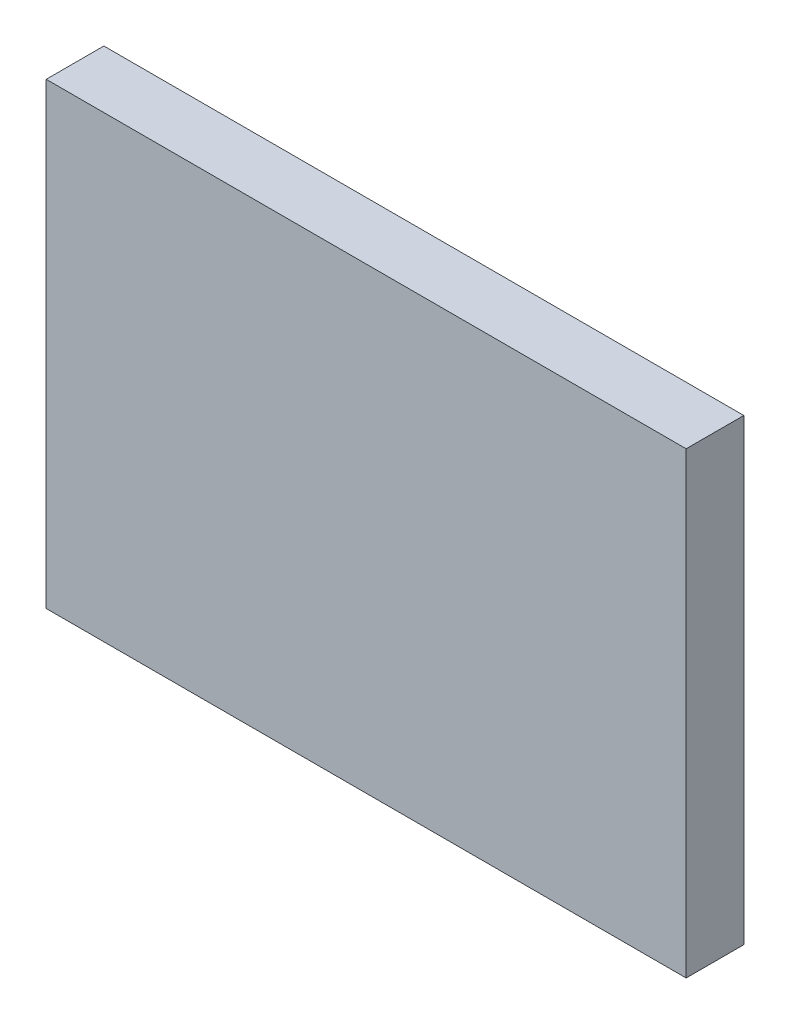
ISO-10303-21;
HEADER;
FILE_DESCRIPTION(('STEP AP214'),'2;1');
FILE_NAME('part.step','',(''),(''),'','','');
FILE_SCHEMA(('AUTOMOTIVE_DESIGN { 1 0 10303 214 1 1 1 1 }'));
ENDSEC;
DATA;
#1=APPLICATION_CONTEXT('core data for automotive mechanical design processes');
#2=APPLICATION_PROTOCOL_DEFINITION('international standard','automotive_design',2000,#1);
#3=PRODUCT_CONTEXT('',#1,'mechanical');
#4=PRODUCT('Part','Part','',(#3));
#5=PRODUCT_RELATED_PRODUCT_CATEGORY('part','',(#4));
#6=PRODUCT_DEFINITION_FORMATION('','',#4);
#7=PRODUCT_DEFINITION_CONTEXT('part definition',#1,'design');
#8=PRODUCT_DEFINITION('design','',#6,#7);
#9=PRODUCT_DEFINITION_SHAPE('','',#8);
#10=(LENGTH_UNIT() NAMED_UNIT(*) SI_UNIT(.MILLI.,.METRE.));
#11=(NAMED_UNIT(*) PLANE_ANGLE_UNIT() SI_UNIT($,.RADIAN.));
#12=(NAMED_UNIT(*) SI_UNIT($,.STERADIAN.) SOLID_ANGLE_UNIT());
#13=UNCERTAINTY_MEASURE_WITH_UNIT(LENGTH_MEASURE(1.E-05),#10,'distance_accuracy_value','');
#14=(GEOMETRIC_REPRESENTATION_CONTEXT(3) GLOBAL_UNCERTAINTY_ASSIGNED_CONTEXT((#13)) GLOBAL_UNIT_ASSIGNED_CONTEXT((#10,
#11,#12)) REPRESENTATION_CONTEXT('',''));
#15=CARTESIAN_POINT('',(0.,0.,0.));
#16=DIRECTION('',(0.,0.,1.));
#17=DIRECTION('',(1.,0.,0.));
#18=AXIS2_PLACEMENT_3D('',#15,#16,#17);
#19=CARTESIAN_POINT('',(-23.3903823640033,18.0832069402377,4.));
#20=DIRECTION('',(1.,0.,0.));
#21=DIRECTION('',(0.,0.,-1.));
#22=AXIS2_PLACEMENT_3D('',#19,#20,#21);
#23=PLANE('',#22);
#24=DIRECTION('',(0.,-1.,0.));
#25=VECTOR('',#24,1.);
#26=CARTESIAN_POINT('',(-23.3903823640033,18.0832069402377,0.));
#27=LINE('',#26,#25);
#28=CARTESIAN_POINT('',(-23.3903823640033,18.0832069402377,0.));
#29=VERTEX_POINT('',#28);
#30=CARTESIAN_POINT('',(-23.3903823640033,-13.7167930597623,0.));
#31=VERTEX_POINT('',#30);
#32=EDGE_CURVE('E96',#29,#31,#27,.T.);
#33=ORIENTED_EDGE('',*,*,#32,.T.);
#34=DIRECTION('',(0.,0.,-1.));
#35=VECTOR('',#34,1.);
#36=CARTESIAN_POINT('',(-23.3903823640033,-13.7167930597623,4.));
#37=LINE('',#36,#35);
#38=CARTESIAN_POINT('',(-23.3903823640033,-13.7167930597623,4.));
#39=VERTEX_POINT('',#38);
#40=EDGE_CURVE('E11',#39,#31,#37,.T.);
#41=ORIENTED_EDGE('',*,*,#40,.F.);
#42=DIRECTION('',(0.,-1.,0.));
#43=VECTOR('',#42,1.);
#44=CARTESIAN_POINT('',(-23.3903823640033,18.0832069402377,4.));
#45=LINE('',#44,#43);
#46=CARTESIAN_POINT('',(-23.3903823640033,18.0832069402377,4.));
#47=VERTEX_POINT('',#46);
#48=EDGE_CURVE('E84',#47,#39,#45,.T.);
#49=ORIENTED_EDGE('',*,*,#48,.F.);
#50=DIRECTION('',(0.,0.,-1.));
#51=VECTOR('',#50,1.);
#52=CARTESIAN_POINT('',(-23.3903823640033,18.0832069402377,4.));
#53=LINE('',#52,#51);
#54=EDGE_CURVE('E92',#47,#29,#53,.T.);
#55=ORIENTED_EDGE('',*,*,#54,.T.);
#56=EDGE_LOOP('',(#33,#41,#49,#55));
#57=FACE_BOUND('',#56,.T.);
#58=ADVANCED_FACE('F33',(#57),#23,.F.);
#59=CARTESIAN_POINT('',(-23.3903823640033,-13.7167930597623,4.));
#60=DIRECTION('',(0.,1.,0.));
#61=DIRECTION('',(0.,0.,1.));
#62=AXIS2_PLACEMENT_3D('',#59,#60,#61);
#63=PLANE('',#62);
#64=DIRECTION('',(1.,0.,0.));
#65=VECTOR('',#64,1.);
#66=CARTESIAN_POINT('',(-23.3903823640033,-13.7167930597623,0.));
#67=LINE('',#66,#65);
#68=CARTESIAN_POINT('',(21.0096176359967,-13.7167930597623,0.));
#69=VERTEX_POINT('',#68);
#70=EDGE_CURVE('E88',#31,#69,#67,.T.);
#71=ORIENTED_EDGE('',*,*,#70,.T.);
#72=DIRECTION('',(0.,0.,-1.));
#73=VECTOR('',#72,1.);
#74=CARTESIAN_POINT('',(21.0096176359967,-13.7167930597623,4.));
#75=LINE('',#74,#73);
#76=CARTESIAN_POINT('',(21.0096176359967,-13.7167930597623,4.));
#77=VERTEX_POINT('',#76);
#78=EDGE_CURVE('E41',#77,#69,#75,.T.);
#79=ORIENTED_EDGE('',*,*,#78,.F.);
#80=DIRECTION('',(1.,0.,0.));
#81=VECTOR('',#80,1.);
#82=CARTESIAN_POINT('',(-23.3903823640033,-13.7167930597623,4.));
#83=LINE('',#82,#81);
#84=EDGE_CURVE('E79',#39,#77,#83,.T.);
#85=ORIENTED_EDGE('',*,*,#84,.F.);
#86=ORIENTED_EDGE('',*,*,#40,.T.);
#87=EDGE_LOOP('',(#71,#79,#85,#86));
#88=FACE_BOUND('',#87,.T.);
#89=ADVANCED_FACE('F87',(#88),#63,.F.);
#90=CARTESIAN_POINT('',(21.0096176359967,18.0832069402377,4.));
#91=DIRECTION('',(-1.,0.,0.));
#92=DIRECTION('',(0.,0.,1.));
#93=AXIS2_PLACEMENT_3D('',#90,#91,#92);
#94=PLANE('',#93);
#95=DIRECTION('',(0.,1.,0.));
#96=VECTOR('',#95,1.);
#97=CARTESIAN_POINT('',(21.0096176359967,18.0832069402377,0.));
#98=LINE('',#97,#96);
#99=CARTESIAN_POINT('',(21.0096176359967,18.0832069402377,0.));
#100=VERTEX_POINT('',#99);
#101=EDGE_CURVE('E66',#69,#100,#98,.T.);
#102=ORIENTED_EDGE('',*,*,#101,.T.);
#103=DIRECTION('',(0.,0.,-1.));
#104=VECTOR('',#103,1.);
#105=CARTESIAN_POINT('',(21.0096176359967,18.0832069402377,4.));
#106=LINE('',#105,#104);
#107=CARTESIAN_POINT('',(21.0096176359967,18.0832069402377,4.));
#108=VERTEX_POINT('',#107);
#109=EDGE_CURVE('E89',#108,#100,#106,.T.);
#110=ORIENTED_EDGE('',*,*,#109,.F.);
#111=DIRECTION('',(0.,1.,0.));
#112=VECTOR('',#111,1.);
#113=CARTESIAN_POINT('',(21.0096176359967,18.0832069402377,4.));
#114=LINE('',#113,#112);
#115=EDGE_CURVE('E82',#77,#108,#114,.T.);
#116=ORIENTED_EDGE('',*,*,#115,.F.);
#117=ORIENTED_EDGE('',*,*,#78,.T.);
#118=EDGE_LOOP('',(#102,#110,#116,#117));
#119=FACE_BOUND('',#118,.T.);
#120=ADVANCED_FACE('F90',(#119),#94,.F.);
#121=CARTESIAN_POINT('',(-23.3903823640033,18.0832069402377,4.));
#122=DIRECTION('',(0.,-1.,0.));
#123=DIRECTION('',(0.,0.,-1.));
#124=AXIS2_PLACEMENT_3D('',#121,#122,#123);
#125=PLANE('',#124);
#126=DIRECTION('',(-1.,0.,0.));
#127=VECTOR('',#126,1.);
#128=CARTESIAN_POINT('',(-23.3903823640033,18.0832069402377,0.));
#129=LINE('',#128,#127);
#130=EDGE_CURVE('E72',#100,#29,#129,.T.);
#131=ORIENTED_EDGE('',*,*,#130,.T.);
#132=ORIENTED_EDGE('',*,*,#54,.F.);
#133=DIRECTION('',(-1.,0.,0.));
#134=VECTOR('',#133,1.);
#135=CARTESIAN_POINT('',(-23.3903823640033,18.0832069402377,4.));
#136=LINE('',#135,#134);
#137=EDGE_CURVE('E49',#108,#47,#136,.T.);
#138=ORIENTED_EDGE('',*,*,#137,.F.);
#139=ORIENTED_EDGE('',*,*,#109,.T.);
#140=EDGE_LOOP('',(#131,#132,#138,#139));
#141=FACE_BOUND('',#140,.T.);
#142=ADVANCED_FACE('F103',(#141),#125,.F.);
#143=CARTESIAN_POINT('',(0.,0.,4.));
#144=DIRECTION('',(0.,0.,1.));
#145=DIRECTION('',(1.,0.,0.));
#146=AXIS2_PLACEMENT_3D('',#143,#144,#145);
#147=PLANE('',#146);
#148=ORIENTED_EDGE('',*,*,#48,.T.);
#149=ORIENTED_EDGE('',*,*,#84,.T.);
#150=ORIENTED_EDGE('',*,*,#115,.T.);
#151=ORIENTED_EDGE('',*,*,#137,.T.);
#152=EDGE_LOOP('',(#148,#149,#150,#151));
#153=FACE_BOUND('',#152,.T.);
#154=ADVANCED_FACE('F80',(#153),#147,.T.);
#155=CARTESIAN_POINT('',(0.,0.,0.));
#156=DIRECTION('',(0.,0.,1.));
#157=DIRECTION('',(1.,0.,0.));
#158=AXIS2_PLACEMENT_3D('',#155,#156,#157);
#159=PLANE('',#158);
#160=ORIENTED_EDGE('',*,*,#32,.F.);
#161=ORIENTED_EDGE('',*,*,#130,.F.);
#162=ORIENTED_EDGE('',*,*,#101,.F.);
#163=ORIENTED_EDGE('',*,*,#70,.F.);
#164=EDGE_LOOP('',(#160,#161,#162,#163));
#165=FACE_BOUND('',#164,.T.);
#166=ADVANCED_FACE('F106',(#165),#159,.F.);
#167=CLOSED_SHELL('',(#58,#89,#120,#142,#154,#166));
#168=MANIFOLD_SOLID_BREP('B2',#167);
#169=ADVANCED_BREP_SHAPE_REPRESENTATION('',(#18,#168),#14);
#170=SHAPE_DEFINITION_REPRESENTATION(#9,#169);
ENDSEC;
END-ISO-10303-21;
